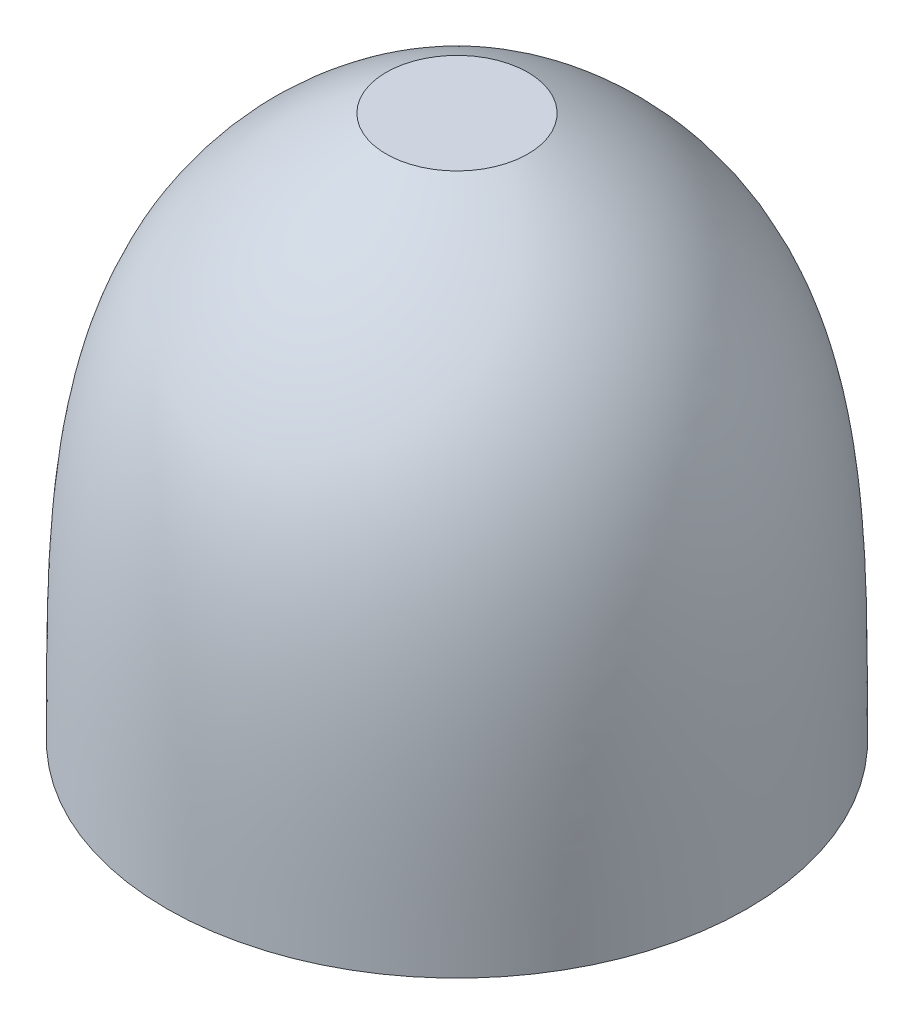
ISO-10303-21;
HEADER;
FILE_DESCRIPTION(('STEP AP214'),'2;1');
FILE_NAME('part.step','',(''),(''),'','','');
FILE_SCHEMA(('AUTOMOTIVE_DESIGN { 1 0 10303 214 1 1 1 1 }'));
ENDSEC;
DATA;
#1=APPLICATION_CONTEXT('core data for automotive mechanical design processes');
#2=APPLICATION_PROTOCOL_DEFINITION('international standard','automotive_design',2000,#1);
#3=PRODUCT_CONTEXT('',#1,'mechanical');
#4=PRODUCT('Part','Part','',(#3));
#5=PRODUCT_RELATED_PRODUCT_CATEGORY('part','',(#4));
#6=PRODUCT_DEFINITION_FORMATION('','',#4);
#7=PRODUCT_DEFINITION_CONTEXT('part definition',#1,'design');
#8=PRODUCT_DEFINITION('design','',#6,#7);
#9=PRODUCT_DEFINITION_SHAPE('','',#8);
#10=(LENGTH_UNIT() NAMED_UNIT(*) SI_UNIT(.MILLI.,.METRE.));
#11=(NAMED_UNIT(*) PLANE_ANGLE_UNIT() SI_UNIT($,.RADIAN.));
#12=(NAMED_UNIT(*) SI_UNIT($,.STERADIAN.) SOLID_ANGLE_UNIT());
#13=UNCERTAINTY_MEASURE_WITH_UNIT(LENGTH_MEASURE(1.E-05),#10,'distance_accuracy_value','');
#14=(GEOMETRIC_REPRESENTATION_CONTEXT(3) GLOBAL_UNCERTAINTY_ASSIGNED_CONTEXT((#13)) GLOBAL_UNIT_ASSIGNED_CONTEXT((#10,
#11,#12)) REPRESENTATION_CONTEXT('',''));
#15=CARTESIAN_POINT('',(0.,0.,0.));
#16=DIRECTION('',(0.,0.,1.));
#17=DIRECTION('',(1.,0.,0.));
#18=AXIS2_PLACEMENT_3D('',#15,#16,#17);
#19=CARTESIAN_POINT('',(5.,58.6,-20.6803059376936));
#20=DIRECTION('',(0.,1.,0.));
#21=DIRECTION('',(0.,0.,1.));
#22=AXIS2_PLACEMENT_3D('',#19,#20,#21);
#23=PLANE('',#22);
#24=CARTESIAN_POINT('',(0.,58.6,0.));
#25=DIRECTION('',(0.,-1.,0.));
#26=DIRECTION('',(0.,0.,-1.));
#27=AXIS2_PLACEMENT_3D('',#24,#25,#26);
#28=CIRCLE('',#27,5.);
#29=CARTESIAN_POINT('',(0.,58.6,-5.));
#30=VERTEX_POINT('',#29);
#31=EDGE_CURVE('E10',#30,#30,#28,.T.);
#32=ORIENTED_EDGE('',*,*,#31,.F.);
#33=EDGE_LOOP('',(#32));
#34=FACE_BOUND('',#33,.T.);
#35=ADVANCED_FACE('F33',(#34),#23,.T.);
#36=CARTESIAN_POINT('',(0.,15.5,0.));
#37=DIRECTION('',(0.,-1.,0.));
#38=DIRECTION('',(0.,0.,-1.));
#39=AXIS2_PLACEMENT_3D('',#36,#37,#38);
#40=PLANE('',#39);
#41=CARTESIAN_POINT('',(0.,15.5,0.));
#42=DIRECTION('',(0.,-1.,0.));
#43=DIRECTION('',(0.,0.,-1.));
#44=AXIS2_PLACEMENT_3D('',#41,#42,#43);
#45=CIRCLE('',#44,7.5);
#46=CARTESIAN_POINT('',(0.,15.5,-7.5));
#47=VERTEX_POINT('',#46);
#48=EDGE_CURVE('E48',#47,#47,#45,.T.);
#49=ORIENTED_EDGE('',*,*,#48,.T.);
#50=EDGE_LOOP('',(#49));
#51=FACE_BOUND('',#50,.T.);
#52=ADVANCED_FACE('F66',(#51),#40,.T.);
#53=CARTESIAN_POINT('',(0.,20.2,0.));
#54=DIRECTION('',(0.,-1.,0.));
#55=DIRECTION('',(0.,0.,-1.));
#56=AXIS2_PLACEMENT_3D('',#53,#54,#55);
#57=CYLINDRICAL_SURFACE('',#56,7.5);
#58=CARTESIAN_POINT('',(0.,20.2,0.));
#59=DIRECTION('',(0.,-1.,0.));
#60=DIRECTION('',(0.,0.,-1.));
#61=AXIS2_PLACEMENT_3D('',#58,#59,#60);
#62=CIRCLE('',#61,7.5);
#63=CARTESIAN_POINT('',(0.,20.2,-7.5));
#64=VERTEX_POINT('',#63);
#65=EDGE_CURVE('E43',#64,#64,#62,.T.);
#66=ORIENTED_EDGE('',*,*,#65,.T.);
#67=EDGE_LOOP('',(#66));
#68=FACE_BOUND('',#67,.T.);
#69=ORIENTED_EDGE('',*,*,#48,.F.);
#70=EDGE_LOOP('',(#69));
#71=FACE_BOUND('',#70,.T.);
#72=ADVANCED_FACE('F63',(#68,#71),#57,.T.);
#73=CARTESIAN_POINT('',(7.5,20.2,0.));
#74=DIRECTION('',(0.,-1.,0.));
#75=DIRECTION('',(0.,0.,-1.));
#76=AXIS2_PLACEMENT_3D('',#73,#74,#75);
#77=PLANE('',#76);
#78=CARTESIAN_POINT('',(0.,20.2,0.));
#79=DIRECTION('',(0.,-1.,0.));
#80=DIRECTION('',(0.,0.,-1.));
#81=AXIS2_PLACEMENT_3D('',#78,#79,#80);
#82=CIRCLE('',#81,20.5);
#83=CARTESIAN_POINT('',(0.,20.2,-20.5));
#84=VERTEX_POINT('',#83);
#85=EDGE_CURVE('E39',#84,#84,#82,.T.);
#86=ORIENTED_EDGE('',*,*,#85,.T.);
#87=EDGE_LOOP('',(#86));
#88=FACE_BOUND('',#87,.T.);
#89=ORIENTED_EDGE('',*,*,#65,.F.);
#90=EDGE_LOOP('',(#89));
#91=FACE_BOUND('',#90,.T.);
#92=ADVANCED_FACE('F60',(#88,#91),#77,.T.);
#93=CARTESIAN_POINT('',(20.5,20.2,0.));
#94=CARTESIAN_POINT('',(20.4744993008068,37.4327476908189,0.));
#95=CARTESIAN_POINT('',(20.8661125745804,50.996454144028,0.));
#96=CARTESIAN_POINT('',(5.00000000000001,58.6,0.));
#97=B_SPLINE_CURVE_WITH_KNOTS('',3,(#93,#94,#95,#96),.UNSPECIFIED.,.F.,.F.,(4,4),(0.,1.),.UNSPECIFIED.);
#98=CARTESIAN_POINT('',(0.,20.2,0.));
#99=DIRECTION('',(0.,-1.,0.));
#100=AXIS1_PLACEMENT('',#98,#99);
#101=SURFACE_OF_REVOLUTION('',#97,#100);
#102=ORIENTED_EDGE('',*,*,#31,.T.);
#103=EDGE_LOOP('',(#102));
#104=FACE_BOUND('',#103,.T.);
#105=ORIENTED_EDGE('',*,*,#85,.F.);
#106=EDGE_LOOP('',(#105));
#107=FACE_BOUND('',#106,.T.);
#108=ADVANCED_FACE('F57',(#104,#107),#101,.F.);
#109=CLOSED_SHELL('',(#35,#52,#72,#92,#108));
#110=MANIFOLD_SOLID_BREP('B2',#109);
#111=ADVANCED_BREP_SHAPE_REPRESENTATION('',(#18,#110),#14);
#112=SHAPE_DEFINITION_REPRESENTATION(#9,#111);
ENDSEC;
END-ISO-10303-21;
